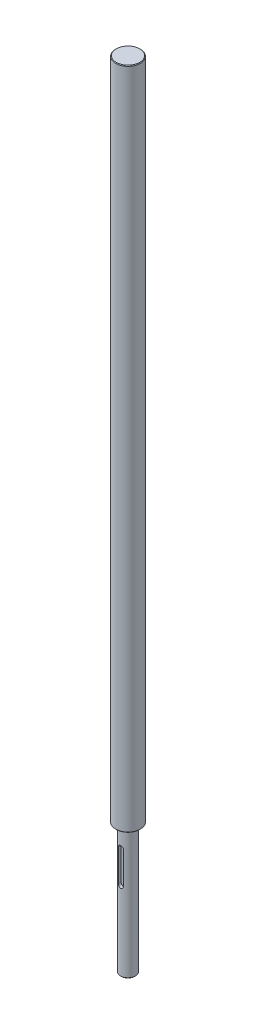
ISO-10303-21;
HEADER;
FILE_DESCRIPTION(('STEP AP214'),'2;1');
FILE_NAME('part.step','',(''),(''),'','','');
FILE_SCHEMA(('AUTOMOTIVE_DESIGN { 1 0 10303 214 1 1 1 1 }'));
ENDSEC;
DATA;
#1=APPLICATION_CONTEXT('core data for automotive mechanical design processes');
#2=APPLICATION_PROTOCOL_DEFINITION('international standard','automotive_design',2000,#1);
#3=PRODUCT_CONTEXT('',#1,'mechanical');
#4=PRODUCT('Part','Part','',(#3));
#5=PRODUCT_RELATED_PRODUCT_CATEGORY('part','',(#4));
#6=PRODUCT_DEFINITION_FORMATION('','',#4);
#7=PRODUCT_DEFINITION_CONTEXT('part definition',#1,'design');
#8=PRODUCT_DEFINITION('design','',#6,#7);
#9=PRODUCT_DEFINITION_SHAPE('','',#8);
#10=(LENGTH_UNIT() NAMED_UNIT(*) SI_UNIT(.MILLI.,.METRE.));
#11=(NAMED_UNIT(*) PLANE_ANGLE_UNIT() SI_UNIT($,.RADIAN.));
#12=(NAMED_UNIT(*) SI_UNIT($,.STERADIAN.) SOLID_ANGLE_UNIT());
#13=UNCERTAINTY_MEASURE_WITH_UNIT(LENGTH_MEASURE(1.E-05),#10,'distance_accuracy_value','');
#14=(GEOMETRIC_REPRESENTATION_CONTEXT(3) GLOBAL_UNCERTAINTY_ASSIGNED_CONTEXT((#13)) GLOBAL_UNIT_ASSIGNED_CONTEXT((#10,
#11,#12)) REPRESENTATION_CONTEXT('',''));
#15=CARTESIAN_POINT('',(0.,0.,0.));
#16=DIRECTION('',(0.,0.,1.));
#17=DIRECTION('',(1.,0.,0.));
#18=AXIS2_PLACEMENT_3D('',#15,#16,#17);
#19=CARTESIAN_POINT('',(0.,-105.,0.));
#20=DIRECTION('',(0.,1.,0.));
#21=DIRECTION('',(0.,0.,1.));
#22=AXIS2_PLACEMENT_3D('',#19,#20,#21);
#23=CYLINDRICAL_SURFACE('',#22,6.);
#24=CARTESIAN_POINT('',(0.,-104.5,0.));
#25=DIRECTION('',(0.,-1.,0.));
#26=DIRECTION('',(0.,0.,-1.));
#27=AXIS2_PLACEMENT_3D('',#24,#25,#26);
#28=CIRCLE('',#27,6.);
#29=CARTESIAN_POINT('',(0.,-104.5,-6.));
#30=VERTEX_POINT('',#29);
#31=EDGE_CURVE('E119',#30,#30,#28,.F.);
#32=ORIENTED_EDGE('',*,*,#31,.T.);
#33=EDGE_LOOP('',(#32));
#34=FACE_BOUND('',#33,.T.);
#35=CARTESIAN_POINT('',(0.,0.,0.));
#36=DIRECTION('',(0.,1.,0.));
#37=DIRECTION('',(0.,0.,1.));
#38=AXIS2_PLACEMENT_3D('',#35,#36,#37);
#39=CIRCLE('',#38,6.);
#40=CARTESIAN_POINT('',(0.,0.,6.));
#41=VERTEX_POINT('',#40);
#42=EDGE_CURVE('E95',#41,#41,#39,.F.);
#43=ORIENTED_EDGE('',*,*,#42,.T.);
#44=EDGE_LOOP('',(#43));
#45=FACE_BOUND('',#44,.T.);
#46=CARTESIAN_POINT('',(2.00000000000063,-15.,5.65685424949216));
#47=CARTESIAN_POINT('',(2.00000149491902,-14.9454190063978,5.65684884188656));
#48=CARTESIAN_POINT('',(1.99776424917541,-14.8908658756214,5.65764519886468));
#49=CARTESIAN_POINT('',(1.98885121407343,-14.7821828318902,5.6607865457842));
#50=CARTESIAN_POINT('',(1.98217662286768,-14.7280528086806,5.66313111768222));
#51=CARTESIAN_POINT('',(1.95562135046221,-14.5672157136097,5.6723818444928));
#52=CARTESIAN_POINT('',(1.92920846605686,-14.4616383074591,5.68150584999009));
#53=CARTESIAN_POINT('',(1.8599168236615,-14.2567496151125,5.70456149397697));
#54=CARTESIAN_POINT('',(1.81704715197571,-14.1574349062542,5.71849047905838));
#55=CARTESIAN_POINT('',(1.71614645793039,-13.9673203319891,5.74957574438902));
#56=CARTESIAN_POINT('',(1.65810612564613,-13.8765257418653,5.76673400456198));
#57=CARTESIAN_POINT('',(1.52610278704669,-13.702559537351,5.80308960804078));
#58=CARTESIAN_POINT('',(1.45164996064474,-13.6197702390748,5.82233755536601));
#59=CARTESIAN_POINT('',(1.28997688598364,-13.4675879644166,5.86027697385941));
#60=CARTESIAN_POINT('',(1.20275436910975,-13.3981973734882,5.87896834543692));
#61=CARTESIAN_POINT('',(1.01520729191321,-13.2730409623916,5.91427765988443));
#62=CARTESIAN_POINT('',(0.914600178717674,-13.2176780311955,5.93082875123697));
#63=CARTESIAN_POINT('',(0.7048584999324,-13.1248154966255,5.95939217209309));
#64=CARTESIAN_POINT('',(0.595726551187521,-13.0873104363591,5.97140588786612));
#65=CARTESIAN_POINT('',(0.376058690956751,-13.0325285478173,5.98918142285841));
#66=CARTESIAN_POINT('',(0.265703668920899,-13.0145934548926,5.99514617977144));
#67=CARTESIAN_POINT('',(0.0433979389120146,-12.9973674029488,6.00087216807633));
#68=CARTESIAN_POINT('',(-0.0685523824901202,-12.9980720014605,6.00063487762605));
#69=CARTESIAN_POINT('',(-0.286207690558126,-13.0176885662133,5.99412077270535));
#70=CARTESIAN_POINT('',(-0.391985405250416,-13.0358852759189,5.98808121982532));
#71=CARTESIAN_POINT('',(-0.59888812875266,-13.0887863973482,5.97093921001654));
#72=CARTESIAN_POINT('',(-0.700012879232278,-13.1234917244125,5.9598364723547));
#73=CARTESIAN_POINT('',(-0.896305246061277,-13.2088427392013,5.93351336542618));
#74=CARTESIAN_POINT('',(-0.991377011307336,-13.2596920902447,5.91824075676636));
#75=CARTESIAN_POINT('',(-1.17184917819433,-13.3757199027814,5.88516775360101));
#76=CARTESIAN_POINT('',(-1.25724693942872,-13.440902262093,5.867366671952));
#77=CARTESIAN_POINT('',(-1.42019467942178,-13.5873420999937,5.83012543885495));
#78=CARTESIAN_POINT('',(-1.49718722322475,-13.6692110872194,5.81064757359845));
#79=CARTESIAN_POINT('',(-1.63654404964012,-13.8448829794323,5.77294980945721));
#80=CARTESIAN_POINT('',(-1.69890360636698,-13.9386897248064,5.75473031831525));
#81=CARTESIAN_POINT('',(-1.80800665118492,-14.1373603567065,5.72140062752656));
#82=CARTESIAN_POINT('',(-1.85450601901472,-14.2423670298658,5.7063402989649));
#83=CARTESIAN_POINT('',(-1.92892046140159,-14.4592939551799,5.681621941241));
#84=CARTESIAN_POINT('',(-1.95686487211008,-14.5712029867443,5.67195538818008));
#85=CARTESIAN_POINT('',(-1.98331631256103,-14.7368372734959,5.66273084189462));
#86=CARTESIAN_POINT('',(-1.9895701225096,-14.7892827797084,5.66053335389226));
#87=CARTESIAN_POINT('',(-1.99790923214177,-14.8944761567996,5.6575940714282));
#88=CARTESIAN_POINT('',(-1.99999991078933,-14.9472235490888,5.65685039859078));
#89=CARTESIAN_POINT('',(-1.99999999999938,-15.,5.6568542494926));
#90=B_SPLINE_CURVE_WITH_KNOTS('',3,(#46,#47,#48,#49,#50,#51,#52,#53,#54,#55,#56,#57,#58,#59,#60,
#61,#62,#63,#64,#65,#66,#67,#68,#69,#70,#71,#72,#73,#74,#75,#76,#77,#78,#79,#80,#81,#82,#83,#84,
#85,#86,#87,#88,#89),.UNSPECIFIED.,.F.,.F.,(4,2,2,2,2,2,2,2,2,2,2,2,2,2,2,2,2,2,2,2,2,4),(0.,
0.163636969470862,0.327229772338915,0.653162396790729,0.978915321932447,1.30486862627059,
1.64233009925352,1.97985159727491,2.326182658662,2.67240782242253,3.00658941454805,
3.34069136061285,3.66168836931471,3.98270317816497,4.30794037651936,4.63326613177537,
4.97388108116099,5.31460588498482,5.66036059856077,6.00556734973674,6.16399790665501,
6.32222363058113),.UNSPECIFIED.);
#91=CARTESIAN_POINT('',(2.00000000000063,-15.,5.65685424949238));
#92=VERTEX_POINT('',#91);
#93=CARTESIAN_POINT('',(-1.99999999999938,-15.,5.6568542494926));
#94=VERTEX_POINT('',#93);
#95=EDGE_CURVE('E122',#92,#94,#90,.T.);
#96=ORIENTED_EDGE('',*,*,#95,.F.);
#97=DIRECTION('',(0.,1.,0.));
#98=VECTOR('',#97,1.);
#99=CARTESIAN_POINT('',(2.,-105.,5.65685424949238));
#100=LINE('',#99,#98);
#101=CARTESIAN_POINT('',(2.00000000000044,-41.,5.65685424949222));
#102=VERTEX_POINT('',#101);
#103=EDGE_CURVE('E11',#102,#92,#100,.T.);
#104=ORIENTED_EDGE('',*,*,#103,.F.);
#105=CARTESIAN_POINT('',(-1.99999999999956,-41.,5.65685424949254));
#106=CARTESIAN_POINT('',(-2.00000149491795,-41.0545809936022,5.65684884188694));
#107=CARTESIAN_POINT('',(-1.99776424917434,-41.1091341243786,5.65764519886506));
#108=CARTESIAN_POINT('',(-1.98885121407236,-41.2178171681098,5.66078654578457));
#109=CARTESIAN_POINT('',(-1.98217662286661,-41.2719471913194,5.6631311176826));
#110=CARTESIAN_POINT('',(-1.95562135046113,-41.4327842863903,5.67238184449317));
#111=CARTESIAN_POINT('',(-1.92920846605578,-41.5383616925409,5.68150584999045));
#112=CARTESIAN_POINT('',(-1.85991682366041,-41.7432503848876,5.70456149397733));
#113=CARTESIAN_POINT('',(-1.81704715197462,-41.8425650937458,5.71849047905873));
#114=CARTESIAN_POINT('',(-1.71614645792929,-42.0326796680109,5.74957574438935));
#115=CARTESIAN_POINT('',(-1.65810612564502,-42.1234742581347,5.76673400456229));
#116=CARTESIAN_POINT('',(-1.52610278704557,-42.2974404626491,5.80308960804107));
#117=CARTESIAN_POINT('',(-1.45164996064362,-42.3802297609252,5.82233755536629));
#118=CARTESIAN_POINT('',(-1.28997688598251,-42.5324120355834,5.86027697385966));
#119=CARTESIAN_POINT('',(-1.20275436910861,-42.6018026265119,5.87896834543715));
#120=CARTESIAN_POINT('',(-1.01520729191207,-42.7269590376084,5.91427765988462));
#121=CARTESIAN_POINT('',(-0.914600178716534,-42.7823219688045,5.93082875123715));
#122=CARTESIAN_POINT('',(-0.70485849993126,-42.8751845033745,5.95939217209322));
#123=CARTESIAN_POINT('',(-0.595726551186382,-42.9126895636409,5.97140588786624));
#124=CARTESIAN_POINT('',(-0.376058690955618,-42.9674714521827,5.98918142285848));
#125=CARTESIAN_POINT('',(-0.265703668919771,-42.9854065451074,5.99514617977149));
#126=CARTESIAN_POINT('',(-0.0433979389108967,-43.0026325970512,6.00087216807634));
#127=CARTESIAN_POINT('',(0.0685523824912321,-43.0019279985395,6.00063487762604));
#128=CARTESIAN_POINT('',(0.286207690559228,-42.9823114337867,5.9941207727053));
#129=CARTESIAN_POINT('',(0.391985405251515,-42.9641147240811,5.98808121982525));
#130=CARTESIAN_POINT('',(0.598888128753752,-42.9112136026517,5.97093921001643));
#131=CARTESIAN_POINT('',(0.700012879233368,-42.8765082755875,5.95983647235457));
#132=CARTESIAN_POINT('',(0.896305246062363,-42.7911572607987,5.93351336542602));
#133=CARTESIAN_POINT('',(0.991377011308422,-42.7403079097553,5.91824075676618));
#134=CARTESIAN_POINT('',(1.17184917819542,-42.6242800972186,5.88516775360079));
#135=CARTESIAN_POINT('',(1.25724693942981,-42.559097737907,5.86736667195177));
#136=CARTESIAN_POINT('',(1.42019467942287,-42.4126579000063,5.83012543885468));
#137=CARTESIAN_POINT('',(1.49718722322584,-42.3307889127806,5.81064757359817));
#138=CARTESIAN_POINT('',(1.63654404964121,-42.1551170205677,5.7729498094569));
#139=CARTESIAN_POINT('',(1.69890360636807,-42.0613102751935,5.75473031831493));
#140=CARTESIAN_POINT('',(1.80800665118601,-41.8626396432934,5.72140062752621));
#141=CARTESIAN_POINT('',(1.85450601901581,-41.7576329701341,5.70634029896455));
#142=CARTESIAN_POINT('',(1.92892046140268,-41.5407060448201,5.68162194124063));
#143=CARTESIAN_POINT('',(1.95686487211116,-41.4287970132557,5.6719553881797));
#144=CARTESIAN_POINT('',(1.9833163125621,-41.263162726504,5.66273084189424));
#145=CARTESIAN_POINT('',(1.98957012251068,-41.2107172202915,5.66053335389188));
#146=CARTESIAN_POINT('',(1.99790923214284,-41.1055238432004,5.65759407142782));
#147=CARTESIAN_POINT('',(1.9999999107904,-41.0527764509112,5.6568503985904));
#148=CARTESIAN_POINT('',(2.00000000000044,-41.,5.65685424949222));
#149=B_SPLINE_CURVE_WITH_KNOTS('',3,(#105,#106,#107,#108,#109,#110,#111,#112,#113,#114,#115,
#116,#117,#118,#119,#120,#121,#122,#123,#124,#125,#126,#127,#128,#129,#130,#131,#132,#133,#134,
#135,#136,#137,#138,#139,#140,#141,#142,#143,#144,#145,#146,#147,#148),.UNSPECIFIED.,.F.,.F.,(4,
2,2,2,2,2,2,2,2,2,2,2,2,2,2,2,2,2,2,2,2,4),(0.,0.163636969470867,0.327229772338926,
0.653162396790755,0.978915321932493,1.30486862627064,1.64233009925357,1.97985159727497,
2.32618265866204,2.67240782242256,3.00658941454806,3.34069136061284,3.6616883693147,
3.98270317816495,4.30794037651935,4.63326613177538,4.97388108116101,5.31460588498486,
5.66036059856082,6.00556734973681,6.16399790665504,6.32222363058113),.UNSPECIFIED.);
#150=CARTESIAN_POINT('',(-1.99999999999956,-41.,5.65685424949238));
#151=VERTEX_POINT('',#150);
#152=EDGE_CURVE('E44',#151,#102,#149,.T.);
#153=ORIENTED_EDGE('',*,*,#152,.F.);
#154=DIRECTION('',(0.,1.,0.));
#155=VECTOR('',#154,1.);
#156=CARTESIAN_POINT('',(-2.,-105.,5.65685424949238));
#157=LINE('',#156,#155);
#158=EDGE_CURVE('E94',#94,#151,#157,.F.);
#159=ORIENTED_EDGE('',*,*,#158,.F.);
#160=EDGE_LOOP('',(#96,#104,#153,#159));
#161=FACE_BOUND('',#160,.T.);
#162=ADVANCED_FACE('F36',(#34,#45,#161),#23,.T.);
#163=CARTESIAN_POINT('',(0.,538.,0.));
#164=DIRECTION('',(0.,-1.,0.));
#165=DIRECTION('',(0.,0.,-1.));
#166=AXIS2_PLACEMENT_3D('',#163,#164,#165);
#167=CYLINDRICAL_SURFACE('',#166,10.);
#168=CARTESIAN_POINT('',(0.,0.499999999999834,0.));
#169=DIRECTION('',(0.,1.,0.));
#170=DIRECTION('',(0.,0.,1.));
#171=AXIS2_PLACEMENT_3D('',#168,#169,#170);
#172=CIRCLE('',#171,10.);
#173=CARTESIAN_POINT('',(0.,0.499999999999834,10.));
#174=VERTEX_POINT('',#173);
#175=EDGE_CURVE('E107',#174,#174,#172,.T.);
#176=ORIENTED_EDGE('',*,*,#175,.T.);
#177=EDGE_LOOP('',(#176));
#178=FACE_BOUND('',#177,.T.);
#179=CARTESIAN_POINT('',(0.,537.5,0.));
#180=DIRECTION('',(0.,1.,0.));
#181=DIRECTION('',(0.,0.,1.));
#182=AXIS2_PLACEMENT_3D('',#179,#180,#181);
#183=CIRCLE('',#182,10.);
#184=CARTESIAN_POINT('',(0.,537.5,10.));
#185=VERTEX_POINT('',#184);
#186=EDGE_CURVE('E99',#185,#185,#183,.F.);
#187=ORIENTED_EDGE('',*,*,#186,.T.);
#188=EDGE_LOOP('',(#187));
#189=FACE_BOUND('',#188,.T.);
#190=ADVANCED_FACE('F159',(#178,#189),#167,.T.);
#191=CARTESIAN_POINT('',(0.,538.,0.));
#192=DIRECTION('',(0.,1.,0.));
#193=DIRECTION('',(0.,0.,1.));
#194=AXIS2_PLACEMENT_3D('',#191,#192,#193);
#195=PLANE('',#194);
#196=CARTESIAN_POINT('',(0.,538.,0.));
#197=DIRECTION('',(0.,1.,0.));
#198=DIRECTION('',(0.,0.,1.));
#199=AXIS2_PLACEMENT_3D('',#196,#197,#198);
#200=CIRCLE('',#199,9.50000000000006);
#201=CARTESIAN_POINT('',(0.,538.,9.50000000000006));
#202=VERTEX_POINT('',#201);
#203=EDGE_CURVE('E113',#202,#202,#200,.T.);
#204=ORIENTED_EDGE('',*,*,#203,.T.);
#205=EDGE_LOOP('',(#204));
#206=FACE_BOUND('',#205,.T.);
#207=ADVANCED_FACE('F164',(#206),#195,.T.);
#208=CARTESIAN_POINT('',(0.,0.,0.));
#209=DIRECTION('',(0.,1.,0.));
#210=DIRECTION('',(0.,0.,1.));
#211=AXIS2_PLACEMENT_3D('',#208,#209,#210);
#212=PLANE('',#211);
#213=CARTESIAN_POINT('',(0.,0.,0.));
#214=DIRECTION('',(0.,1.,0.));
#215=DIRECTION('',(0.,0.,1.));
#216=AXIS2_PLACEMENT_3D('',#213,#214,#215);
#217=CIRCLE('',#216,9.50000000000012);
#218=CARTESIAN_POINT('',(0.,0.,9.50000000000012));
#219=VERTEX_POINT('',#218);
#220=EDGE_CURVE('E110',#219,#219,#217,.F.);
#221=ORIENTED_EDGE('',*,*,#220,.T.);
#222=EDGE_LOOP('',(#221));
#223=FACE_BOUND('',#222,.T.);
#224=ORIENTED_EDGE('',*,*,#42,.F.);
#225=EDGE_LOOP('',(#224));
#226=FACE_BOUND('',#225,.T.);
#227=ADVANCED_FACE('F171',(#223,#226),#212,.F.);
#228=CARTESIAN_POINT('',(0.,-105.,0.));
#229=DIRECTION('',(0.,-1.,0.));
#230=DIRECTION('',(0.,0.,-1.));
#231=AXIS2_PLACEMENT_3D('',#228,#229,#230);
#232=PLANE('',#231);
#233=CARTESIAN_POINT('',(0.,-105.,0.));
#234=DIRECTION('',(0.,-1.,0.));
#235=DIRECTION('',(0.,0.,-1.));
#236=AXIS2_PLACEMENT_3D('',#233,#234,#235);
#237=CIRCLE('',#236,5.49999999999995);
#238=CARTESIAN_POINT('',(0.,-105.,-5.49999999999995));
#239=VERTEX_POINT('',#238);
#240=EDGE_CURVE('E116',#239,#239,#237,.T.);
#241=ORIENTED_EDGE('',*,*,#240,.T.);
#242=EDGE_LOOP('',(#241));
#243=FACE_BOUND('',#242,.T.);
#244=ADVANCED_FACE('F144',(#243),#232,.T.);
#245=CARTESIAN_POINT('',(0.,0.499999999999834,0.));
#246=DIRECTION('',(0.,1.,0.));
#247=DIRECTION('',(0.,0.,1.));
#248=AXIS2_PLACEMENT_3D('',#245,#246,#247);
#249=CONICAL_SURFACE('',#248,10.,0.785398163397493);
#250=ORIENTED_EDGE('',*,*,#220,.F.);
#251=EDGE_LOOP('',(#250));
#252=FACE_BOUND('',#251,.T.);
#253=ORIENTED_EDGE('',*,*,#175,.F.);
#254=EDGE_LOOP('',(#253));
#255=FACE_BOUND('',#254,.T.);
#256=ADVANCED_FACE('F179',(#252,#255),#249,.T.);
#257=CARTESIAN_POINT('',(0.,538.,0.));
#258=DIRECTION('',(0.,-1.,0.));
#259=DIRECTION('',(0.,0.,-1.));
#260=AXIS2_PLACEMENT_3D('',#257,#258,#259);
#261=CONICAL_SURFACE('',#260,9.50000000000006,0.785398163397438);
#262=ORIENTED_EDGE('',*,*,#186,.F.);
#263=EDGE_LOOP('',(#262));
#264=FACE_BOUND('',#263,.T.);
#265=ORIENTED_EDGE('',*,*,#203,.F.);
#266=EDGE_LOOP('',(#265));
#267=FACE_BOUND('',#266,.T.);
#268=ADVANCED_FACE('F184',(#264,#267),#261,.T.);
#269=CARTESIAN_POINT('',(0.,-105.,0.));
#270=DIRECTION('',(0.,1.,0.));
#271=DIRECTION('',(0.,0.,1.));
#272=AXIS2_PLACEMENT_3D('',#269,#270,#271);
#273=CONICAL_SURFACE('',#272,5.49999999999995,0.785398163397486);
#274=ORIENTED_EDGE('',*,*,#31,.F.);
#275=EDGE_LOOP('',(#274));
#276=FACE_BOUND('',#275,.T.);
#277=ORIENTED_EDGE('',*,*,#240,.F.);
#278=EDGE_LOOP('',(#277));
#279=FACE_BOUND('',#278,.T.);
#280=ADVANCED_FACE('F38',(#276,#279),#273,.T.);
#281=CARTESIAN_POINT('',(4.29036869688722E-13,-41.,3.5));
#282=DIRECTION('',(0.,0.,1.));
#283=DIRECTION('',(1.,0.,0.));
#284=AXIS2_PLACEMENT_3D('',#281,#282,#283);
#285=CYLINDRICAL_SURFACE('',#284,2.);
#286=DIRECTION('',(0.,0.,1.));
#287=VECTOR('',#286,1.);
#288=CARTESIAN_POINT('',(-1.99999999999957,-41.,3.50000000000002));
#289=LINE('',#288,#287);
#290=CARTESIAN_POINT('',(-1.99999999999957,-41.,3.50000000000002));
#291=VERTEX_POINT('',#290);
#292=EDGE_CURVE('E91',#291,#151,#289,.T.);
#293=ORIENTED_EDGE('',*,*,#292,.T.);
#294=ORIENTED_EDGE('',*,*,#152,.T.);
#295=DIRECTION('',(0.,0.,1.));
#296=VECTOR('',#295,1.);
#297=CARTESIAN_POINT('',(2.00000000000043,-41.,3.49999999999999));
#298=LINE('',#297,#296);
#299=CARTESIAN_POINT('',(2.00000000000043,-41.,3.49999999999999));
#300=VERTEX_POINT('',#299);
#301=EDGE_CURVE('E50',#300,#102,#298,.T.);
#302=ORIENTED_EDGE('',*,*,#301,.F.);
#303=CARTESIAN_POINT('',(4.29036869688722E-13,-41.,3.5));
#304=DIRECTION('',(0.,0.,-1.));
#305=DIRECTION('',(1.,0.,0.));
#306=AXIS2_PLACEMENT_3D('',#303,#304,#305);
#307=CIRCLE('',#306,2.);
#308=EDGE_CURVE('E81',#300,#291,#307,.T.);
#309=ORIENTED_EDGE('',*,*,#308,.T.);
#310=EDGE_LOOP('',(#293,#294,#302,#309));
#311=FACE_BOUND('',#310,.T.);
#312=ADVANCED_FACE('F90',(#311),#285,.F.);
#313=CARTESIAN_POINT('',(-1.99999999999957,-41.,3.50000000000002));
#314=DIRECTION('',(1.,0.,0.));
#315=DIRECTION('',(0.,0.,-1.));
#316=AXIS2_PLACEMENT_3D('',#313,#314,#315);
#317=PLANE('',#316);
#318=ORIENTED_EDGE('',*,*,#158,.T.);
#319=ORIENTED_EDGE('',*,*,#292,.F.);
#320=DIRECTION('',(0.,1.,0.));
#321=VECTOR('',#320,1.);
#322=CARTESIAN_POINT('',(-1.99999999999957,-41.,3.50000000000002));
#323=LINE('',#322,#321);
#324=CARTESIAN_POINT('',(-1.99999999999939,-15.,3.50000000000002));
#325=VERTEX_POINT('',#324);
#326=EDGE_CURVE('E77',#291,#325,#323,.T.);
#327=ORIENTED_EDGE('',*,*,#326,.T.);
#328=DIRECTION('',(0.,0.,1.));
#329=VECTOR('',#328,1.);
#330=CARTESIAN_POINT('',(-1.99999999999939,-15.,3.50000000000002));
#331=LINE('',#330,#329);
#332=EDGE_CURVE('E96',#325,#94,#331,.T.);
#333=ORIENTED_EDGE('',*,*,#332,.T.);
#334=EDGE_LOOP('',(#318,#319,#327,#333));
#335=FACE_BOUND('',#334,.T.);
#336=ADVANCED_FACE('F93',(#335),#317,.T.);
#337=CARTESIAN_POINT('',(6.10315472928299E-13,-15.,3.50000000000001));
#338=DIRECTION('',(0.,0.,1.));
#339=DIRECTION('',(1.,0.,0.));
#340=AXIS2_PLACEMENT_3D('',#337,#338,#339);
#341=CYLINDRICAL_SURFACE('',#340,2.);
#342=DIRECTION('',(0.,0.,1.));
#343=VECTOR('',#342,1.);
#344=CARTESIAN_POINT('',(2.00000000000061,-15.,3.49999999999999));
#345=LINE('',#344,#343);
#346=CARTESIAN_POINT('',(2.00000000000061,-15.,3.49999999999999));
#347=VERTEX_POINT('',#346);
#348=EDGE_CURVE('E101',#347,#92,#345,.T.);
#349=ORIENTED_EDGE('',*,*,#348,.T.);
#350=ORIENTED_EDGE('',*,*,#95,.T.);
#351=ORIENTED_EDGE('',*,*,#332,.F.);
#352=CARTESIAN_POINT('',(6.10315472928299E-13,-15.,3.50000000000001));
#353=DIRECTION('',(0.,0.,-1.));
#354=DIRECTION('',(-1.,0.,0.));
#355=AXIS2_PLACEMENT_3D('',#352,#353,#354);
#356=CIRCLE('',#355,2.);
#357=EDGE_CURVE('E82',#325,#347,#356,.T.);
#358=ORIENTED_EDGE('',*,*,#357,.T.);
#359=EDGE_LOOP('',(#349,#350,#351,#358));
#360=FACE_BOUND('',#359,.T.);
#361=ADVANCED_FACE('F132',(#360),#341,.F.);
#362=CARTESIAN_POINT('',(2.00000000000043,-41.,3.49999999999999));
#363=DIRECTION('',(-1.,0.,0.));
#364=DIRECTION('',(0.,-1.,0.));
#365=AXIS2_PLACEMENT_3D('',#362,#363,#364);
#366=PLANE('',#365);
#367=ORIENTED_EDGE('',*,*,#103,.T.);
#368=ORIENTED_EDGE('',*,*,#348,.F.);
#369=DIRECTION('',(0.,-1.,0.));
#370=VECTOR('',#369,1.);
#371=CARTESIAN_POINT('',(2.00000000000043,-41.,3.49999999999999));
#372=LINE('',#371,#370);
#373=EDGE_CURVE('E150',#347,#300,#372,.T.);
#374=ORIENTED_EDGE('',*,*,#373,.T.);
#375=ORIENTED_EDGE('',*,*,#301,.T.);
#376=EDGE_LOOP('',(#367,#368,#374,#375));
#377=FACE_BOUND('',#376,.T.);
#378=ADVANCED_FACE('F137',(#377),#366,.T.);
#379=CARTESIAN_POINT('',(4.29036869688722E-13,-41.,3.5));
#380=DIRECTION('',(0.,0.,1.));
#381=DIRECTION('',(1.,0.,0.));
#382=AXIS2_PLACEMENT_3D('',#379,#380,#381);
#383=PLANE('',#382);
#384=ORIENTED_EDGE('',*,*,#308,.F.);
#385=ORIENTED_EDGE('',*,*,#373,.F.);
#386=ORIENTED_EDGE('',*,*,#357,.F.);
#387=ORIENTED_EDGE('',*,*,#326,.F.);
#388=EDGE_LOOP('',(#384,#385,#386,#387));
#389=FACE_BOUND('',#388,.T.);
#390=ADVANCED_FACE('F79',(#389),#383,.T.);
#391=CLOSED_SHELL('',(#162,#190,#207,#227,#244,#256,#268,#280,#312,#336,#361,#378,#390));
#392=MANIFOLD_SOLID_BREP('B2',#391);
#393=ADVANCED_BREP_SHAPE_REPRESENTATION('',(#18,#392),#14);
#394=SHAPE_DEFINITION_REPRESENTATION(#9,#393);
ENDSEC;
END-ISO-10303-21;
